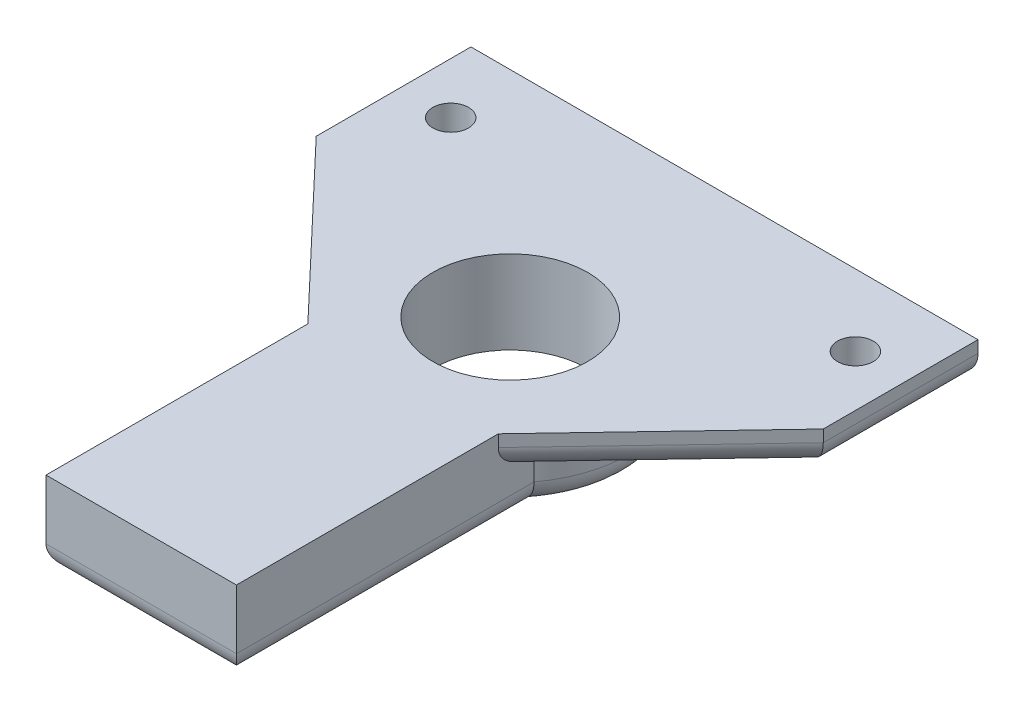
ISO-10303-21;
HEADER;
FILE_DESCRIPTION(('STEP AP214'),'2;1');
FILE_NAME('part.step','',(''),(''),'','','');
FILE_SCHEMA(('AUTOMOTIVE_DESIGN { 1 0 10303 214 1 1 1 1 }'));
ENDSEC;
DATA;
#1=APPLICATION_CONTEXT('core data for automotive mechanical design processes');
#2=APPLICATION_PROTOCOL_DEFINITION('international standard','automotive_design',2000,#1);
#3=PRODUCT_CONTEXT('',#1,'mechanical');
#4=PRODUCT('Part','Part','',(#3));
#5=PRODUCT_RELATED_PRODUCT_CATEGORY('part','',(#4));
#6=PRODUCT_DEFINITION_FORMATION('','',#4);
#7=PRODUCT_DEFINITION_CONTEXT('part definition',#1,'design');
#8=PRODUCT_DEFINITION('design','',#6,#7);
#9=PRODUCT_DEFINITION_SHAPE('','',#8);
#10=(LENGTH_UNIT() NAMED_UNIT(*) SI_UNIT(.MILLI.,.METRE.));
#11=(NAMED_UNIT(*) PLANE_ANGLE_UNIT() SI_UNIT($,.RADIAN.));
#12=(NAMED_UNIT(*) SI_UNIT($,.STERADIAN.) SOLID_ANGLE_UNIT());
#13=UNCERTAINTY_MEASURE_WITH_UNIT(LENGTH_MEASURE(1.E-05),#10,'distance_accuracy_value','');
#14=(GEOMETRIC_REPRESENTATION_CONTEXT(3) GLOBAL_UNCERTAINTY_ASSIGNED_CONTEXT((#13)) GLOBAL_UNIT_ASSIGNED_CONTEXT((#10,
#11,#12)) REPRESENTATION_CONTEXT('',''));
#15=CARTESIAN_POINT('',(0.,0.,0.));
#16=DIRECTION('',(0.,0.,1.));
#17=DIRECTION('',(1.,0.,0.));
#18=AXIS2_PLACEMENT_3D('',#15,#16,#17);
#19=CARTESIAN_POINT('',(-4.,1.5,0.));
#20=DIRECTION('',(1.,0.,0.));
#21=DIRECTION('',(0.,0.,-1.));
#22=AXIS2_PLACEMENT_3D('',#19,#20,#21);
#23=PLANE('',#22);
#24=DIRECTION('',(0.,1.,0.));
#25=VECTOR('',#24,1.);
#26=CARTESIAN_POINT('',(-4.,-2.,-12.5));
#27=LINE('',#26,#25);
#28=CARTESIAN_POINT('',(-4.,-1.,-12.5));
#29=VERTEX_POINT('',#28);
#30=CARTESIAN_POINT('',(-4.,0.,-12.5));
#31=VERTEX_POINT('',#30);
#32=EDGE_CURVE('E147',#29,#31,#27,.T.);
#33=ORIENTED_EDGE('',*,*,#32,.F.);
#34=DIRECTION('',(0.,0.,-1.));
#35=VECTOR('',#34,1.);
#36=CARTESIAN_POINT('',(-4.,-1.,0.));
#37=LINE('',#36,#35);
#38=CARTESIAN_POINT('',(-4.,-1.,0.));
#39=VERTEX_POINT('',#38);
#40=EDGE_CURVE('E230',#29,#39,#37,.F.);
#41=ORIENTED_EDGE('',*,*,#40,.T.);
#42=DIRECTION('',(0.,-1.,0.));
#43=VECTOR('',#42,1.);
#44=CARTESIAN_POINT('',(-4.,1.5,0.));
#45=LINE('',#44,#43);
#46=CARTESIAN_POINT('',(-4.,1.5,0.));
#47=VERTEX_POINT('',#46);
#48=EDGE_CURVE('E153',#47,#39,#45,.T.);
#49=ORIENTED_EDGE('',*,*,#48,.F.);
#50=DIRECTION('',(0.,0.,1.));
#51=VECTOR('',#50,1.);
#52=CARTESIAN_POINT('',(-4.,1.5,0.));
#53=LINE('',#52,#51);
#54=CARTESIAN_POINT('',(-4.,1.5,-11.));
#55=VERTEX_POINT('',#54);
#56=EDGE_CURVE('E179',#55,#47,#53,.T.);
#57=ORIENTED_EDGE('',*,*,#56,.F.);
#58=DIRECTION('',(0.,-1.,0.));
#59=VECTOR('',#58,1.);
#60=CARTESIAN_POINT('',(-4.,1.5,-11.));
#61=LINE('',#60,#59);
#62=CARTESIAN_POINT('',(-4.,1.,-11.));
#63=VERTEX_POINT('',#62);
#64=EDGE_CURVE('E196',#55,#63,#61,.T.);
#65=ORIENTED_EDGE('',*,*,#64,.T.);
#66=CARTESIAN_POINT('',(-4.,1.,-12.4519067604351));
#67=DIRECTION('',(1.,0.,0.));
#68=DIRECTION('',(0.,0.,-1.));
#69=AXIS2_PLACEMENT_3D('',#66,#67,#68);
#70=ELLIPSE('',#69,1.45190676043513,1.);
#71=CARTESIAN_POINT('',(-4.,0.,-12.4519067604351));
#72=VERTEX_POINT('',#71);
#73=EDGE_CURVE('E11',#63,#72,#70,.T.);
#74=ORIENTED_EDGE('',*,*,#73,.T.);
#75=DIRECTION('',(0.,0.,-1.));
#76=VECTOR('',#75,1.);
#77=CARTESIAN_POINT('',(-4.,0.,-12.5));
#78=LINE('',#77,#76);
#79=EDGE_CURVE('E145',#72,#31,#78,.T.);
#80=ORIENTED_EDGE('',*,*,#79,.T.);
#81=EDGE_LOOP('',(#33,#41,#49,#57,#65,#74,#80));
#82=FACE_BOUND('',#81,.T.);
#83=ADVANCED_FACE('F35',(#82),#23,.F.);
#84=CARTESIAN_POINT('',(4.,1.5,0.));
#85=DIRECTION('',(0.,0.,-1.));
#86=DIRECTION('',(-1.,0.,0.));
#87=AXIS2_PLACEMENT_3D('',#84,#85,#86);
#88=PLANE('',#87);
#89=ORIENTED_EDGE('',*,*,#48,.T.);
#90=DIRECTION('',(-1.,0.,0.));
#91=VECTOR('',#90,1.);
#92=CARTESIAN_POINT('',(4.,-1.,0.));
#93=LINE('',#92,#91);
#94=CARTESIAN_POINT('',(4.,-1.,0.));
#95=VERTEX_POINT('',#94);
#96=EDGE_CURVE('E232',#39,#95,#93,.F.);
#97=ORIENTED_EDGE('',*,*,#96,.T.);
#98=DIRECTION('',(0.,-1.,0.));
#99=VECTOR('',#98,1.);
#100=CARTESIAN_POINT('',(4.,1.5,0.));
#101=LINE('',#100,#99);
#102=CARTESIAN_POINT('',(4.,1.5,0.));
#103=VERTEX_POINT('',#102);
#104=EDGE_CURVE('E213',#103,#95,#101,.T.);
#105=ORIENTED_EDGE('',*,*,#104,.F.);
#106=DIRECTION('',(1.,0.,0.));
#107=VECTOR('',#106,1.);
#108=CARTESIAN_POINT('',(4.,1.5,0.));
#109=LINE('',#108,#107);
#110=EDGE_CURVE('E182',#47,#103,#109,.T.);
#111=ORIENTED_EDGE('',*,*,#110,.F.);
#112=EDGE_LOOP('',(#89,#97,#105,#111));
#113=FACE_BOUND('',#112,.T.);
#114=ADVANCED_FACE('F287',(#113),#88,.F.);
#115=CARTESIAN_POINT('',(3.99999999999999,1.5,-11.));
#116=DIRECTION('',(-1.,0.,0.));
#117=DIRECTION('',(0.,0.,1.));
#118=AXIS2_PLACEMENT_3D('',#115,#116,#117);
#119=PLANE('',#118);
#120=ORIENTED_EDGE('',*,*,#104,.T.);
#121=DIRECTION('',(0.,0.,1.));
#122=VECTOR('',#121,1.);
#123=CARTESIAN_POINT('',(3.99999999999999,-1.,-12.5));
#124=LINE('',#123,#122);
#125=CARTESIAN_POINT('',(4.,-1.,-12.5));
#126=VERTEX_POINT('',#125);
#127=EDGE_CURVE('E226',#95,#126,#124,.F.);
#128=ORIENTED_EDGE('',*,*,#127,.T.);
#129=DIRECTION('',(0.,1.,0.));
#130=VECTOR('',#129,1.);
#131=CARTESIAN_POINT('',(4.,-2.,-12.5));
#132=LINE('',#131,#130);
#133=CARTESIAN_POINT('',(4.,0.,-12.5));
#134=VERTEX_POINT('',#133);
#135=EDGE_CURVE('E163',#126,#134,#132,.T.);
#136=ORIENTED_EDGE('',*,*,#135,.T.);
#137=DIRECTION('',(0.,0.,1.));
#138=VECTOR('',#137,1.);
#139=CARTESIAN_POINT('',(4.,0.,0.));
#140=LINE('',#139,#138);
#141=CARTESIAN_POINT('',(4.,0.,-12.4519067604351));
#142=VERTEX_POINT('',#141);
#143=EDGE_CURVE('E169',#134,#142,#140,.T.);
#144=ORIENTED_EDGE('',*,*,#143,.T.);
#145=CARTESIAN_POINT('',(3.99999999999999,1.,-12.4519067604351));
#146=DIRECTION('',(-1.,0.,0.));
#147=DIRECTION('',(0.,0.,1.));
#148=AXIS2_PLACEMENT_3D('',#145,#146,#147);
#149=ELLIPSE('',#148,1.45190676043513,1.);
#150=CARTESIAN_POINT('',(3.99999999999999,1.,-11.));
#151=VERTEX_POINT('',#150);
#152=EDGE_CURVE('E44',#142,#151,#149,.T.);
#153=ORIENTED_EDGE('',*,*,#152,.T.);
#154=DIRECTION('',(0.,-1.,0.));
#155=VECTOR('',#154,1.);
#156=CARTESIAN_POINT('',(3.99999999999999,1.5,-11.));
#157=LINE('',#156,#155);
#158=CARTESIAN_POINT('',(3.99999999999999,1.5,-11.));
#159=VERTEX_POINT('',#158);
#160=EDGE_CURVE('E210',#159,#151,#157,.T.);
#161=ORIENTED_EDGE('',*,*,#160,.F.);
#162=DIRECTION('',(0.,0.,-1.));
#163=VECTOR('',#162,1.);
#164=CARTESIAN_POINT('',(3.99999999999999,1.5,-11.));
#165=LINE('',#164,#163);
#166=EDGE_CURVE('E184',#103,#159,#165,.T.);
#167=ORIENTED_EDGE('',*,*,#166,.F.);
#168=EDGE_LOOP('',(#120,#128,#136,#144,#153,#161,#167));
#169=FACE_BOUND('',#168,.T.);
#170=ADVANCED_FACE('F291',(#169),#119,.F.);
#171=CARTESIAN_POINT('',(10.65,1.5,-18.));
#172=DIRECTION('',(-0.724999433594413,0.,-0.688749461914693));
#173=DIRECTION('',(-0.688749461914694,0.,0.724999433594413));
#174=AXIS2_PLACEMENT_3D('',#171,#172,#173);
#175=PLANE('',#174);
#176=ORIENTED_EDGE('',*,*,#160,.T.);
#177=DIRECTION('',(0.688749461914694,0.,-0.724999433594413));
#178=VECTOR('',#177,1.);
#179=CARTESIAN_POINT('',(10.65,1.,-18.));
#180=LINE('',#179,#178);
#181=CARTESIAN_POINT('',(10.65,1.,-18.));
#182=VERTEX_POINT('',#181);
#183=EDGE_CURVE('E382',#151,#182,#180,.T.);
#184=ORIENTED_EDGE('',*,*,#183,.T.);
#185=DIRECTION('',(0.,-1.,0.));
#186=VECTOR('',#185,1.);
#187=CARTESIAN_POINT('',(10.65,1.5,-18.));
#188=LINE('',#187,#186);
#189=CARTESIAN_POINT('',(10.65,1.5,-18.));
#190=VERTEX_POINT('',#189);
#191=EDGE_CURVE('E207',#190,#182,#188,.T.);
#192=ORIENTED_EDGE('',*,*,#191,.F.);
#193=DIRECTION('',(0.688749461914694,0.,-0.724999433594413));
#194=VECTOR('',#193,1.);
#195=CARTESIAN_POINT('',(10.65,1.5,-18.));
#196=LINE('',#195,#194);
#197=EDGE_CURVE('E186',#159,#190,#196,.T.);
#198=ORIENTED_EDGE('',*,*,#197,.F.);
#199=EDGE_LOOP('',(#176,#184,#192,#198));
#200=FACE_BOUND('',#199,.T.);
#201=ADVANCED_FACE('F297',(#200),#175,.F.);
#202=CARTESIAN_POINT('',(10.65,1.5,-24.5));
#203=DIRECTION('',(-1.,0.,0.));
#204=DIRECTION('',(0.,0.,1.));
#205=AXIS2_PLACEMENT_3D('',#202,#203,#204);
#206=PLANE('',#205);
#207=ORIENTED_EDGE('',*,*,#191,.T.);
#208=DIRECTION('',(0.,0.,-1.));
#209=VECTOR('',#208,1.);
#210=CARTESIAN_POINT('',(10.65,1.,-24.5));
#211=LINE('',#210,#209);
#212=CARTESIAN_POINT('',(10.65,1.,-24.5));
#213=VERTEX_POINT('',#212);
#214=EDGE_CURVE('E234',#182,#213,#211,.T.);
#215=ORIENTED_EDGE('',*,*,#214,.T.);
#216=DIRECTION('',(0.,-1.,0.));
#217=VECTOR('',#216,1.);
#218=CARTESIAN_POINT('',(10.65,1.5,-24.5));
#219=LINE('',#218,#217);
#220=CARTESIAN_POINT('',(10.65,1.5,-24.5));
#221=VERTEX_POINT('',#220);
#222=EDGE_CURVE('E204',#221,#213,#219,.T.);
#223=ORIENTED_EDGE('',*,*,#222,.F.);
#224=DIRECTION('',(0.,0.,-1.));
#225=VECTOR('',#224,1.);
#226=CARTESIAN_POINT('',(10.65,1.5,-24.5));
#227=LINE('',#226,#225);
#228=EDGE_CURVE('E188',#190,#221,#227,.T.);
#229=ORIENTED_EDGE('',*,*,#228,.F.);
#230=EDGE_LOOP('',(#207,#215,#223,#229));
#231=FACE_BOUND('',#230,.T.);
#232=ADVANCED_FACE('F301',(#231),#206,.F.);
#233=CARTESIAN_POINT('',(-10.65,1.5,-24.5));
#234=DIRECTION('',(0.,0.,1.));
#235=DIRECTION('',(1.,0.,0.));
#236=AXIS2_PLACEMENT_3D('',#233,#234,#235);
#237=PLANE('',#236);
#238=ORIENTED_EDGE('',*,*,#222,.T.);
#239=CARTESIAN_POINT('',(9.65,1.,-24.5));
#240=DIRECTION('',(0.,0.,1.));
#241=DIRECTION('',(1.,0.,0.));
#242=AXIS2_PLACEMENT_3D('',#239,#240,#241);
#243=CIRCLE('',#242,1.);
#244=CARTESIAN_POINT('',(9.65,0.,-24.5));
#245=VERTEX_POINT('',#244);
#246=EDGE_CURVE('E398',#213,#245,#243,.F.);
#247=ORIENTED_EDGE('',*,*,#246,.T.);
#248=DIRECTION('',(-1.,0.,0.));
#249=VECTOR('',#248,1.);
#250=CARTESIAN_POINT('',(-10.65,0.,-24.5));
#251=LINE('',#250,#249);
#252=CARTESIAN_POINT('',(-9.65,0.,-24.5));
#253=VERTEX_POINT('',#252);
#254=EDGE_CURVE('E162',#245,#253,#251,.T.);
#255=ORIENTED_EDGE('',*,*,#254,.T.);
#256=CARTESIAN_POINT('',(-9.65,1.,-24.5));
#257=DIRECTION('',(0.,0.,1.));
#258=DIRECTION('',(1.,0.,0.));
#259=AXIS2_PLACEMENT_3D('',#256,#257,#258);
#260=CIRCLE('',#259,1.);
#261=CARTESIAN_POINT('',(-10.65,1.,-24.5));
#262=VERTEX_POINT('',#261);
#263=EDGE_CURVE('E397',#253,#262,#260,.F.);
#264=ORIENTED_EDGE('',*,*,#263,.T.);
#265=DIRECTION('',(0.,-1.,0.));
#266=VECTOR('',#265,1.);
#267=CARTESIAN_POINT('',(-10.65,1.5,-24.5));
#268=LINE('',#267,#266);
#269=CARTESIAN_POINT('',(-10.65,1.5,-24.5));
#270=VERTEX_POINT('',#269);
#271=EDGE_CURVE('E202',#270,#262,#268,.T.);
#272=ORIENTED_EDGE('',*,*,#271,.F.);
#273=DIRECTION('',(-1.,0.,0.));
#274=VECTOR('',#273,1.);
#275=CARTESIAN_POINT('',(-10.65,1.5,-24.5));
#276=LINE('',#275,#274);
#277=EDGE_CURVE('E190',#221,#270,#276,.T.);
#278=ORIENTED_EDGE('',*,*,#277,.F.);
#279=EDGE_LOOP('',(#238,#247,#255,#264,#272,#278));
#280=FACE_BOUND('',#279,.T.);
#281=ADVANCED_FACE('F305',(#280),#237,.F.);
#282=CARTESIAN_POINT('',(-10.65,1.5,-18.));
#283=DIRECTION('',(1.,0.,0.));
#284=DIRECTION('',(0.,0.,-1.));
#285=AXIS2_PLACEMENT_3D('',#282,#283,#284);
#286=PLANE('',#285);
#287=ORIENTED_EDGE('',*,*,#271,.T.);
#288=DIRECTION('',(0.,0.,1.));
#289=VECTOR('',#288,1.);
#290=CARTESIAN_POINT('',(-10.65,1.,-18.));
#291=LINE('',#290,#289);
#292=CARTESIAN_POINT('',(-10.65,1.,-18.));
#293=VERTEX_POINT('',#292);
#294=EDGE_CURVE('E52',#262,#293,#291,.T.);
#295=ORIENTED_EDGE('',*,*,#294,.T.);
#296=DIRECTION('',(0.,-1.,0.));
#297=VECTOR('',#296,1.);
#298=CARTESIAN_POINT('',(-10.65,1.5,-18.));
#299=LINE('',#298,#297);
#300=CARTESIAN_POINT('',(-10.65,1.5,-18.));
#301=VERTEX_POINT('',#300);
#302=EDGE_CURVE('E200',#301,#293,#299,.T.);
#303=ORIENTED_EDGE('',*,*,#302,.F.);
#304=DIRECTION('',(0.,0.,1.));
#305=VECTOR('',#304,1.);
#306=CARTESIAN_POINT('',(-10.65,1.5,-18.));
#307=LINE('',#306,#305);
#308=EDGE_CURVE('E192',#270,#301,#307,.T.);
#309=ORIENTED_EDGE('',*,*,#308,.F.);
#310=EDGE_LOOP('',(#287,#295,#303,#309));
#311=FACE_BOUND('',#310,.T.);
#312=ADVANCED_FACE('F309',(#311),#286,.F.);
#313=CARTESIAN_POINT('',(-10.65,1.5,-18.));
#314=DIRECTION('',(0.724999433594414,0.,-0.688749461914693));
#315=DIRECTION('',(-0.688749461914693,0.,-0.724999433594414));
#316=AXIS2_PLACEMENT_3D('',#313,#314,#315);
#317=PLANE('',#316);
#318=ORIENTED_EDGE('',*,*,#302,.T.);
#319=DIRECTION('',(0.688749461914693,0.,0.724999433594414));
#320=VECTOR('',#319,1.);
#321=CARTESIAN_POINT('',(-4.,1.,-11.));
#322=LINE('',#321,#320);
#323=EDGE_CURVE('E380',#293,#63,#322,.T.);
#324=ORIENTED_EDGE('',*,*,#323,.T.);
#325=ORIENTED_EDGE('',*,*,#64,.F.);
#326=DIRECTION('',(0.688749461914693,0.,0.724999433594414));
#327=VECTOR('',#326,1.);
#328=CARTESIAN_POINT('',(-10.65,1.5,-18.));
#329=LINE('',#328,#327);
#330=EDGE_CURVE('E194',#301,#55,#329,.T.);
#331=ORIENTED_EDGE('',*,*,#330,.F.);
#332=EDGE_LOOP('',(#318,#324,#325,#331));
#333=FACE_BOUND('',#332,.T.);
#334=ADVANCED_FACE('F313',(#333),#317,.F.);
#335=CARTESIAN_POINT('',(0.,1.5,0.));
#336=DIRECTION('',(0.,-1.,0.));
#337=DIRECTION('',(0.,0.,-1.));
#338=AXIS2_PLACEMENT_3D('',#335,#336,#337);
#339=PLANE('',#338);
#340=CARTESIAN_POINT('',(-8.5,1.5,-21.5));
#341=DIRECTION('',(0.,-1.,0.));
#342=DIRECTION('',(0.,0.,-1.));
#343=AXIS2_PLACEMENT_3D('',#340,#341,#342);
#344=CIRCLE('',#343,0.75);
#345=CARTESIAN_POINT('',(-8.5,1.5,-22.25));
#346=VERTEX_POINT('',#345);
#347=EDGE_CURVE('E340',#346,#346,#344,.T.);
#348=ORIENTED_EDGE('',*,*,#347,.T.);
#349=EDGE_LOOP('',(#348));
#350=FACE_BOUND('',#349,.T.);
#351=CARTESIAN_POINT('',(8.5,1.5,-21.5));
#352=DIRECTION('',(0.,-1.,0.));
#353=DIRECTION('',(0.,0.,-1.));
#354=AXIS2_PLACEMENT_3D('',#351,#352,#353);
#355=CIRCLE('',#354,0.75);
#356=CARTESIAN_POINT('',(8.5,1.5,-22.25));
#357=VERTEX_POINT('',#356);
#358=EDGE_CURVE('E344',#357,#357,#355,.T.);
#359=ORIENTED_EDGE('',*,*,#358,.T.);
#360=EDGE_LOOP('',(#359));
#361=FACE_BOUND('',#360,.T.);
#362=CARTESIAN_POINT('',(0.,1.5,-15.5));
#363=DIRECTION('',(0.,-1.,0.));
#364=DIRECTION('',(0.,0.,-1.));
#365=AXIS2_PLACEMENT_3D('',#362,#363,#364);
#366=CIRCLE('',#365,3.25);
#367=CARTESIAN_POINT('',(0.,1.5,-18.75));
#368=VERTEX_POINT('',#367);
#369=EDGE_CURVE('E354',#368,#368,#366,.T.);
#370=ORIENTED_EDGE('',*,*,#369,.T.);
#371=EDGE_LOOP('',(#370));
#372=FACE_BOUND('',#371,.T.);
#373=ORIENTED_EDGE('',*,*,#56,.T.);
#374=ORIENTED_EDGE('',*,*,#110,.T.);
#375=ORIENTED_EDGE('',*,*,#166,.T.);
#376=ORIENTED_EDGE('',*,*,#197,.T.);
#377=ORIENTED_EDGE('',*,*,#228,.T.);
#378=ORIENTED_EDGE('',*,*,#277,.T.);
#379=ORIENTED_EDGE('',*,*,#308,.T.);
#380=ORIENTED_EDGE('',*,*,#330,.T.);
#381=EDGE_LOOP('',(#373,#374,#375,#376,#377,#378,#379,#380));
#382=FACE_BOUND('',#381,.T.);
#383=ADVANCED_FACE('F316',(#350,#361,#372,#382),#339,.F.);
#384=CARTESIAN_POINT('',(0.,0.,0.));
#385=DIRECTION('',(0.,-1.,0.));
#386=DIRECTION('',(0.,0.,-1.));
#387=AXIS2_PLACEMENT_3D('',#384,#385,#386);
#388=PLANE('',#387);
#389=CARTESIAN_POINT('',(-8.5,0.,-21.5));
#390=DIRECTION('',(0.,-1.,0.));
#391=DIRECTION('',(0.,0.,-1.));
#392=AXIS2_PLACEMENT_3D('',#389,#390,#391);
#393=CIRCLE('',#392,0.75);
#394=CARTESIAN_POINT('',(-8.5,0.,-22.25));
#395=VERTEX_POINT('',#394);
#396=EDGE_CURVE('E343',#395,#395,#393,.T.);
#397=ORIENTED_EDGE('',*,*,#396,.F.);
#398=EDGE_LOOP('',(#397));
#399=FACE_BOUND('',#398,.T.);
#400=CARTESIAN_POINT('',(8.5,0.,-21.5));
#401=DIRECTION('',(0.,-1.,0.));
#402=DIRECTION('',(0.,0.,-1.));
#403=AXIS2_PLACEMENT_3D('',#400,#401,#402);
#404=CIRCLE('',#403,0.75);
#405=CARTESIAN_POINT('',(8.5,0.,-22.25));
#406=VERTEX_POINT('',#405);
#407=EDGE_CURVE('E349',#406,#406,#404,.T.);
#408=ORIENTED_EDGE('',*,*,#407,.F.);
#409=EDGE_LOOP('',(#408));
#410=FACE_BOUND('',#409,.T.);
#411=ORIENTED_EDGE('',*,*,#254,.F.);
#412=DIRECTION('',(0.,0.,-1.));
#413=VECTOR('',#412,1.);
#414=CARTESIAN_POINT('',(9.65,0.,-18.));
#415=LINE('',#414,#413);
#416=CARTESIAN_POINT('',(9.65,0.,-18.3992751814878));
#417=VERTEX_POINT('',#416);
#418=EDGE_CURVE('E385',#245,#417,#415,.F.);
#419=ORIENTED_EDGE('',*,*,#418,.T.);
#420=DIRECTION('',(0.688749461914694,0.,-0.724999433594413));
#421=VECTOR('',#420,1.);
#422=CARTESIAN_POINT('',(3.27500056640558,0.,-11.6887494619147));
#423=LINE('',#422,#421);
#424=EDGE_CURVE('E400',#417,#142,#423,.F.);
#425=ORIENTED_EDGE('',*,*,#424,.T.);
#426=ORIENTED_EDGE('',*,*,#143,.F.);
#427=CARTESIAN_POINT('',(0.,0.,-15.5));
#428=DIRECTION('',(0.,-1.,0.));
#429=DIRECTION('',(0.,0.,-1.));
#430=AXIS2_PLACEMENT_3D('',#427,#428,#429);
#431=CIRCLE('',#430,5.);
#432=EDGE_CURVE('E159',#31,#134,#431,.T.);
#433=ORIENTED_EDGE('',*,*,#432,.F.);
#434=ORIENTED_EDGE('',*,*,#79,.F.);
#435=DIRECTION('',(0.688749461914693,0.,0.724999433594414));
#436=VECTOR('',#435,1.);
#437=CARTESIAN_POINT('',(-9.92500056640559,0.,-18.6887494619147));
#438=LINE('',#437,#436);
#439=CARTESIAN_POINT('',(-9.65,0.,-18.3992751814878));
#440=VERTEX_POINT('',#439);
#441=EDGE_CURVE('E393',#72,#440,#438,.F.);
#442=ORIENTED_EDGE('',*,*,#441,.T.);
#443=DIRECTION('',(0.,0.,1.));
#444=VECTOR('',#443,1.);
#445=CARTESIAN_POINT('',(-9.65,0.,-24.5));
#446=LINE('',#445,#444);
#447=EDGE_CURVE('E396',#440,#253,#446,.F.);
#448=ORIENTED_EDGE('',*,*,#447,.T.);
#449=EDGE_LOOP('',(#411,#419,#425,#426,#433,#434,#442,#448));
#450=FACE_BOUND('',#449,.T.);
#451=ADVANCED_FACE('F167',(#399,#410,#450),#388,.T.);
#452=CARTESIAN_POINT('',(0.,-2.,-15.5));
#453=DIRECTION('',(0.,1.,0.));
#454=DIRECTION('',(0.,0.,1.));
#455=AXIS2_PLACEMENT_3D('',#452,#453,#454);
#456=CYLINDRICAL_SURFACE('',#455,5.);
#457=ORIENTED_EDGE('',*,*,#135,.F.);
#458=CARTESIAN_POINT('',(0.,-1.,-15.5));
#459=DIRECTION('',(0.,-1.,0.));
#460=DIRECTION('',(0.,0.,-1.));
#461=AXIS2_PLACEMENT_3D('',#458,#459,#460);
#462=CIRCLE('',#461,5.);
#463=EDGE_CURVE('E161',#126,#29,#462,.F.);
#464=ORIENTED_EDGE('',*,*,#463,.T.);
#465=ORIENTED_EDGE('',*,*,#32,.T.);
#466=ORIENTED_EDGE('',*,*,#432,.T.);
#467=EDGE_LOOP('',(#457,#464,#465,#466));
#468=FACE_BOUND('',#467,.T.);
#469=ADVANCED_FACE('F158',(#468),#456,.T.);
#470=CARTESIAN_POINT('',(0.,-2.,-15.5));
#471=DIRECTION('',(0.,-1.,0.));
#472=DIRECTION('',(0.,0.,-1.));
#473=AXIS2_PLACEMENT_3D('',#470,#471,#472);
#474=PLANE('',#473);
#475=CARTESIAN_POINT('',(0.,-2.,-15.5));
#476=DIRECTION('',(0.,-1.,0.));
#477=DIRECTION('',(0.,0.,-1.));
#478=AXIS2_PLACEMENT_3D('',#475,#476,#477);
#479=CIRCLE('',#478,3.25);
#480=CARTESIAN_POINT('',(0.,-2.,-18.75));
#481=VERTEX_POINT('',#480);
#482=EDGE_CURVE('E346',#481,#481,#479,.T.);
#483=ORIENTED_EDGE('',*,*,#482,.F.);
#484=EDGE_LOOP('',(#483));
#485=FACE_BOUND('',#484,.T.);
#486=CARTESIAN_POINT('',(0.,-2.,-15.5));
#487=DIRECTION('',(0.,-1.,0.));
#488=DIRECTION('',(0.,0.,-1.));
#489=AXIS2_PLACEMENT_3D('',#486,#487,#488);
#490=CIRCLE('',#489,4.);
#491=CARTESIAN_POINT('',(-3.,-2.,-12.8542486889354));
#492=VERTEX_POINT('',#491);
#493=CARTESIAN_POINT('',(2.99999999999999,-2.,-12.8542486889354));
#494=VERTEX_POINT('',#493);
#495=EDGE_CURVE('E221',#492,#494,#490,.T.);
#496=ORIENTED_EDGE('',*,*,#495,.T.);
#497=DIRECTION('',(0.,0.,1.));
#498=VECTOR('',#497,1.);
#499=CARTESIAN_POINT('',(3.,-2.,0.));
#500=LINE('',#499,#498);
#501=CARTESIAN_POINT('',(3.,-2.,-1.));
#502=VERTEX_POINT('',#501);
#503=EDGE_CURVE('E223',#494,#502,#500,.T.);
#504=ORIENTED_EDGE('',*,*,#503,.T.);
#505=DIRECTION('',(-1.,0.,0.));
#506=VECTOR('',#505,1.);
#507=CARTESIAN_POINT('',(-4.,-2.,-1.));
#508=LINE('',#507,#506);
#509=CARTESIAN_POINT('',(-3.,-2.,-1.));
#510=VERTEX_POINT('',#509);
#511=EDGE_CURVE('E152',#502,#510,#508,.T.);
#512=ORIENTED_EDGE('',*,*,#511,.T.);
#513=DIRECTION('',(0.,0.,-1.));
#514=VECTOR('',#513,1.);
#515=CARTESIAN_POINT('',(-3.,-2.,-12.5));
#516=LINE('',#515,#514);
#517=EDGE_CURVE('E219',#510,#492,#516,.T.);
#518=ORIENTED_EDGE('',*,*,#517,.T.);
#519=EDGE_LOOP('',(#496,#504,#512,#518));
#520=FACE_BOUND('',#519,.T.);
#521=ADVANCED_FACE('F265',(#485,#520),#474,.T.);
#522=CARTESIAN_POINT('',(-3.,-1.,-15.5));
#523=DIRECTION('',(0.,0.,1.));
#524=DIRECTION('',(1.,0.,0.));
#525=AXIS2_PLACEMENT_3D('',#522,#523,#524);
#526=CYLINDRICAL_SURFACE('',#525,1.);
#527=CARTESIAN_POINT('',(-3.,-1.,-1.));
#528=DIRECTION('',(0.707106781186548,0.,0.707106781186547));
#529=DIRECTION('',(0.707106781186547,0.,-0.707106781186547));
#530=AXIS2_PLACEMENT_3D('',#527,#528,#529);
#531=ELLIPSE('',#530,1.4142135623731,1.);
#532=EDGE_CURVE('E174',#39,#510,#531,.T.);
#533=ORIENTED_EDGE('',*,*,#532,.F.);
#534=ORIENTED_EDGE('',*,*,#40,.F.);
#535=CARTESIAN_POINT('',(-4.,-1.,-12.5));
#536=CARTESIAN_POINT('',(-4.00000053065337,-1.02705816721718,-12.5000000401213));
#537=CARTESIAN_POINT('',(-3.99890103150178,-1.05410302021816,-12.5003662986292));
#538=CARTESIAN_POINT('',(-3.99451947124923,-1.10799170235667,-12.501827268073));
#539=CARTESIAN_POINT('',(-3.99123772024455,-1.13483555950756,-12.5029218755113));
#540=CARTESIAN_POINT('',(-3.97817015115517,-1.21466116163073,-12.5072839596271));
#541=CARTESIAN_POINT('',(-3.96516178275892,-1.26709571074683,-12.511629756073));
#542=CARTESIAN_POINT('',(-3.93102286413063,-1.36889468625411,-12.5230757342197));
#543=CARTESIAN_POINT('',(-3.9098921612798,-1.4182590549363,-12.5301759676765));
#544=CARTESIAN_POINT('',(-3.86024886385784,-1.5126548782515,-12.5469392527743));
#545=CARTESIAN_POINT('',(-3.8317351774656,-1.55768569067107,-12.556602683475));
#546=CARTESIAN_POINT('',(-3.76762878092849,-1.64316237965455,-12.578462886493));
#547=CARTESIAN_POINT('',(-3.73190536450849,-1.68349797324346,-12.5907066523354));
#548=CARTESIAN_POINT('',(-3.65488183271775,-1.75762008937728,-12.6173032933906));
#549=CARTESIAN_POINT('',(-3.61357999195903,-1.79140457778148,-12.6316568212675));
#550=CARTESIAN_POINT('',(-3.52448417121065,-1.85322809777233,-12.6628846364371));
#551=CARTESIAN_POINT('',(-3.47647204123827,-1.88090742616746,-12.6798476143925));
#552=CARTESIAN_POINT('',(-3.37702381288994,-1.92783380100277,-12.7153345102268));
#553=CARTESIAN_POINT('',(-3.32558734314164,-1.94707993113427,-12.7338585974675));
#554=CARTESIAN_POINT('',(-3.22969537031329,-1.9743120022973,-12.7687655491415));
#555=CARTESIAN_POINT('',(-3.18555394650592,-1.98366231680011,-12.7849714095704));
#556=CARTESIAN_POINT('',(-3.09667146612374,-1.99632476261743,-12.8179088350617));
#557=CARTESIAN_POINT('',(-3.05193170349826,-1.99964829591977,-12.8346393463825));
#558=CARTESIAN_POINT('',(-3.00484956222036,-1.99999120163255,-12.8524161998457));
#559=CARTESIAN_POINT('',(-3.00242462509712,-2.00000002188338,-12.8533322634626));
#560=CARTESIAN_POINT('',(-3.,-2.,-12.8542486889354));
#561=B_SPLINE_CURVE_WITH_KNOTS('',3,(#535,#536,#537,#538,#539,#540,#541,#542,#543,#544,#545,
#546,#547,#548,#549,#550,#551,#552,#553,#554,#555,#556,#557,#558,#559,#560),.UNSPECIFIED.,.F.,
.F.,(4,2,2,2,2,2,2,2,2,2,2,2,4),(0.,0.0811234341008538,0.162235343088034,0.323989046975475,
0.485745790365848,0.647526468578011,0.812557239981791,0.977639172241434,1.15075644913021,
1.32389253140546,1.46736091900348,1.61055759634134,1.61833416484338),.UNSPECIFIED.);
#562=EDGE_CURVE('E170',#492,#29,#561,.F.);
#563=ORIENTED_EDGE('',*,*,#562,.F.);
#564=ORIENTED_EDGE('',*,*,#517,.F.);
#565=EDGE_LOOP('',(#533,#534,#563,#564));
#566=FACE_BOUND('',#565,.T.);
#567=ADVANCED_FACE('F253',(#566),#526,.T.);
#568=CARTESIAN_POINT('',(0.,-1.,-15.5));
#569=DIRECTION('',(0.,-1.,0.));
#570=DIRECTION('',(0.,0.,-1.));
#571=AXIS2_PLACEMENT_3D('',#568,#569,#570);
#572=TOROIDAL_SURFACE('',#571,4.,1.);
#573=ORIENTED_EDGE('',*,*,#562,.T.);
#574=ORIENTED_EDGE('',*,*,#463,.F.);
#575=CARTESIAN_POINT('',(4.,-1.,-12.5));
#576=CARTESIAN_POINT('',(4.00000053065336,-1.02705816721718,-12.5000000401213));
#577=CARTESIAN_POINT('',(3.99890103150177,-1.05410302021816,-12.5003662986292));
#578=CARTESIAN_POINT('',(3.99451947124922,-1.10799170235667,-12.501827268073));
#579=CARTESIAN_POINT('',(3.99123772024455,-1.13483555950756,-12.5029218755112));
#580=CARTESIAN_POINT('',(3.97817015115516,-1.21466116163073,-12.5072839596271));
#581=CARTESIAN_POINT('',(3.96516178275892,-1.26709571074683,-12.511629756073));
#582=CARTESIAN_POINT('',(3.93102286413062,-1.36889468625411,-12.5230757342197));
#583=CARTESIAN_POINT('',(3.90989216127979,-1.4182590549363,-12.5301759676765));
#584=CARTESIAN_POINT('',(3.86024886385783,-1.5126548782515,-12.5469392527743));
#585=CARTESIAN_POINT('',(3.83173517746559,-1.55768569067107,-12.556602683475));
#586=CARTESIAN_POINT('',(3.76762878092849,-1.64316237965455,-12.578462886493));
#587=CARTESIAN_POINT('',(3.73190536450848,-1.68349797324346,-12.5907066523354));
#588=CARTESIAN_POINT('',(3.65488183271774,-1.75762008937728,-12.6173032933906));
#589=CARTESIAN_POINT('',(3.61357999195903,-1.79140457778148,-12.6316568212675));
#590=CARTESIAN_POINT('',(3.52448417121064,-1.85322809777233,-12.6628846364371));
#591=CARTESIAN_POINT('',(3.47647204123826,-1.88090742616746,-12.6798476143924));
#592=CARTESIAN_POINT('',(3.37702381288993,-1.92783380100277,-12.7153345102268));
#593=CARTESIAN_POINT('',(3.32558734314164,-1.94707993113427,-12.7338585974676));
#594=CARTESIAN_POINT('',(3.22969537031327,-1.9743120022973,-12.7687655491414));
#595=CARTESIAN_POINT('',(3.18555394650587,-1.98366231680011,-12.7849714095703));
#596=CARTESIAN_POINT('',(3.09667146612378,-1.99632476261743,-12.8179088350618));
#597=CARTESIAN_POINT('',(3.05193170349842,-1.99964829591977,-12.8346393463829));
#598=CARTESIAN_POINT('',(3.00484956222037,-1.99999120163255,-12.8524161998458));
#599=CARTESIAN_POINT('',(3.00242462509712,-2.00000002188338,-12.8533322634626));
#600=CARTESIAN_POINT('',(2.99999999999999,-2.,-12.8542486889354));
#601=B_SPLINE_CURVE_WITH_KNOTS('',3,(#575,#576,#577,#578,#579,#580,#581,#582,#583,#584,#585,
#586,#587,#588,#589,#590,#591,#592,#593,#594,#595,#596,#597,#598,#599,#600),.UNSPECIFIED.,.F.,
.F.,(4,2,2,2,2,2,2,2,2,2,2,2,4),(0.,0.0811234341008538,0.162235343088034,0.323989046975476,
0.48574579036585,0.647526468578012,0.812557239981791,0.977639172241434,1.15075644913021,
1.32389253140546,1.46736091900347,1.61055759634134,1.61833416484338),.UNSPECIFIED.);
#602=EDGE_CURVE('E237',#494,#126,#601,.F.);
#603=ORIENTED_EDGE('',*,*,#602,.F.);
#604=ORIENTED_EDGE('',*,*,#495,.F.);
#605=EDGE_LOOP('',(#573,#574,#603,#604));
#606=FACE_BOUND('',#605,.T.);
#607=ADVANCED_FACE('F248',(#606),#572,.T.);
#608=CARTESIAN_POINT('',(0.,-1.,-1.));
#609=DIRECTION('',(1.,0.,0.));
#610=DIRECTION('',(0.,0.,-1.));
#611=AXIS2_PLACEMENT_3D('',#608,#609,#610);
#612=CYLINDRICAL_SURFACE('',#611,1.);
#613=ORIENTED_EDGE('',*,*,#532,.T.);
#614=ORIENTED_EDGE('',*,*,#511,.F.);
#615=CARTESIAN_POINT('',(3.,-1.,-1.));
#616=DIRECTION('',(0.707106781186547,0.,-0.707106781186548));
#617=DIRECTION('',(0.707106781186548,0.,0.707106781186547));
#618=AXIS2_PLACEMENT_3D('',#615,#616,#617);
#619=ELLIPSE('',#618,1.4142135623731,1.);
#620=EDGE_CURVE('E235',#95,#502,#619,.T.);
#621=ORIENTED_EDGE('',*,*,#620,.F.);
#622=ORIENTED_EDGE('',*,*,#96,.F.);
#623=EDGE_LOOP('',(#613,#614,#621,#622));
#624=FACE_BOUND('',#623,.T.);
#625=ADVANCED_FACE('F252',(#624),#612,.T.);
#626=CARTESIAN_POINT('',(2.99999999999999,-1.,-15.5));
#627=DIRECTION('',(0.,0.,-1.));
#628=DIRECTION('',(-1.,0.,0.));
#629=AXIS2_PLACEMENT_3D('',#626,#627,#628);
#630=CYLINDRICAL_SURFACE('',#629,1.);
#631=ORIENTED_EDGE('',*,*,#602,.T.);
#632=ORIENTED_EDGE('',*,*,#127,.F.);
#633=ORIENTED_EDGE('',*,*,#620,.T.);
#634=ORIENTED_EDGE('',*,*,#503,.F.);
#635=EDGE_LOOP('',(#631,#632,#633,#634));
#636=FACE_BOUND('',#635,.T.);
#637=ADVANCED_FACE('F245',(#636),#630,.T.);
#638=CARTESIAN_POINT('',(9.92500056640559,1.,-18.6887494619147));
#639=DIRECTION('',(-0.688749461914694,0.,0.724999433594413));
#640=DIRECTION('',(0.724999433594413,0.,0.688749461914694));
#641=AXIS2_PLACEMENT_3D('',#638,#639,#640);
#642=CYLINDRICAL_SURFACE('',#641,1.);
#643=ORIENTED_EDGE('',*,*,#152,.F.);
#644=ORIENTED_EDGE('',*,*,#424,.F.);
#645=CARTESIAN_POINT('',(9.65,1.,-18.3992751814878));
#646=DIRECTION('',(-0.370810306225155,0.,0.928708628579065));
#647=DIRECTION('',(-0.928708628579064,0.,-0.370810306225155));
#648=AXIS2_PLACEMENT_3D('',#645,#646,#647);
#649=ELLIPSE('',#648,1.07676398089465,1.);
#650=EDGE_CURVE('E238',#182,#417,#649,.F.);
#651=ORIENTED_EDGE('',*,*,#650,.F.);
#652=ORIENTED_EDGE('',*,*,#183,.F.);
#653=EDGE_LOOP('',(#643,#644,#651,#652));
#654=FACE_BOUND('',#653,.T.);
#655=ADVANCED_FACE('F270',(#654),#642,.T.);
#656=CARTESIAN_POINT('',(9.65,1.,-24.5));
#657=DIRECTION('',(0.,0.,1.));
#658=DIRECTION('',(1.,0.,0.));
#659=AXIS2_PLACEMENT_3D('',#656,#657,#658);
#660=CYLINDRICAL_SURFACE('',#659,1.);
#661=ORIENTED_EDGE('',*,*,#650,.T.);
#662=ORIENTED_EDGE('',*,*,#418,.F.);
#663=ORIENTED_EDGE('',*,*,#246,.F.);
#664=ORIENTED_EDGE('',*,*,#214,.F.);
#665=EDGE_LOOP('',(#661,#662,#663,#664));
#666=FACE_BOUND('',#665,.T.);
#667=ADVANCED_FACE('F267',(#666),#660,.T.);
#668=CARTESIAN_POINT('',(-9.65,1.,-18.));
#669=DIRECTION('',(0.,0.,-1.));
#670=DIRECTION('',(-1.,0.,0.));
#671=AXIS2_PLACEMENT_3D('',#668,#669,#670);
#672=CYLINDRICAL_SURFACE('',#671,1.);
#673=ORIENTED_EDGE('',*,*,#263,.F.);
#674=ORIENTED_EDGE('',*,*,#447,.F.);
#675=CARTESIAN_POINT('',(-9.65,1.,-18.3992751814878));
#676=DIRECTION('',(-0.370810306225155,0.,-0.928708628579064));
#677=DIRECTION('',(0.928708628579065,0.,-0.370810306225155));
#678=AXIS2_PLACEMENT_3D('',#675,#676,#677);
#679=ELLIPSE('',#678,1.07676398089465,1.);
#680=EDGE_CURVE('E39',#293,#440,#679,.F.);
#681=ORIENTED_EDGE('',*,*,#680,.F.);
#682=ORIENTED_EDGE('',*,*,#294,.F.);
#683=EDGE_LOOP('',(#673,#674,#681,#682));
#684=FACE_BOUND('',#683,.T.);
#685=ADVANCED_FACE('F37',(#684),#672,.T.);
#686=CARTESIAN_POINT('',(-9.92500056640559,1.,-18.6887494619147));
#687=DIRECTION('',(-0.688749461914693,0.,-0.724999433594414));
#688=DIRECTION('',(-0.724999433594414,0.,0.688749461914693));
#689=AXIS2_PLACEMENT_3D('',#686,#687,#688);
#690=CYLINDRICAL_SURFACE('',#689,1.);
#691=ORIENTED_EDGE('',*,*,#680,.T.);
#692=ORIENTED_EDGE('',*,*,#441,.F.);
#693=ORIENTED_EDGE('',*,*,#73,.F.);
#694=ORIENTED_EDGE('',*,*,#323,.F.);
#695=EDGE_LOOP('',(#691,#692,#693,#694));
#696=FACE_BOUND('',#695,.T.);
#697=ADVANCED_FACE('F274',(#696),#690,.T.);
#698=CARTESIAN_POINT('',(0.,1.5,-15.5));
#699=DIRECTION('',(0.,-1.,0.));
#700=DIRECTION('',(0.,0.,-1.));
#701=AXIS2_PLACEMENT_3D('',#698,#699,#700);
#702=CYLINDRICAL_SURFACE('',#701,3.25);
#703=ORIENTED_EDGE('',*,*,#369,.F.);
#704=EDGE_LOOP('',(#703));
#705=FACE_BOUND('',#704,.T.);
#706=ORIENTED_EDGE('',*,*,#482,.T.);
#707=EDGE_LOOP('',(#706));
#708=FACE_BOUND('',#707,.T.);
#709=ADVANCED_FACE('F276',(#705,#708),#702,.F.);
#710=CARTESIAN_POINT('',(8.5,1.5,-21.5));
#711=DIRECTION('',(0.,-1.,0.));
#712=DIRECTION('',(0.,0.,-1.));
#713=AXIS2_PLACEMENT_3D('',#710,#711,#712);
#714=CYLINDRICAL_SURFACE('',#713,0.75);
#715=ORIENTED_EDGE('',*,*,#358,.F.);
#716=EDGE_LOOP('',(#715));
#717=FACE_BOUND('',#716,.T.);
#718=ORIENTED_EDGE('',*,*,#407,.T.);
#719=EDGE_LOOP('',(#718));
#720=FACE_BOUND('',#719,.T.);
#721=ADVANCED_FACE('F281',(#717,#720),#714,.F.);
#722=CARTESIAN_POINT('',(-8.5,1.5,-21.5));
#723=DIRECTION('',(0.,-1.,0.));
#724=DIRECTION('',(0.,0.,-1.));
#725=AXIS2_PLACEMENT_3D('',#722,#723,#724);
#726=CYLINDRICAL_SURFACE('',#725,0.75);
#727=ORIENTED_EDGE('',*,*,#347,.F.);
#728=EDGE_LOOP('',(#727));
#729=FACE_BOUND('',#728,.T.);
#730=ORIENTED_EDGE('',*,*,#396,.T.);
#731=EDGE_LOOP('',(#730));
#732=FACE_BOUND('',#731,.T.);
#733=ADVANCED_FACE('F331',(#729,#732),#726,.F.);
#734=CLOSED_SHELL('',(#83,#114,#170,#201,#232,#281,#312,#334,#383,#451,#469,#521,#567,#607,#625,
#637,#655,#667,#685,#697,#709,#721,#733));
#735=MANIFOLD_SOLID_BREP('B2',#734);
#736=ADVANCED_BREP_SHAPE_REPRESENTATION('',(#18,#735),#14);
#737=SHAPE_DEFINITION_REPRESENTATION(#9,#736);
ENDSEC;
END-ISO-10303-21;
